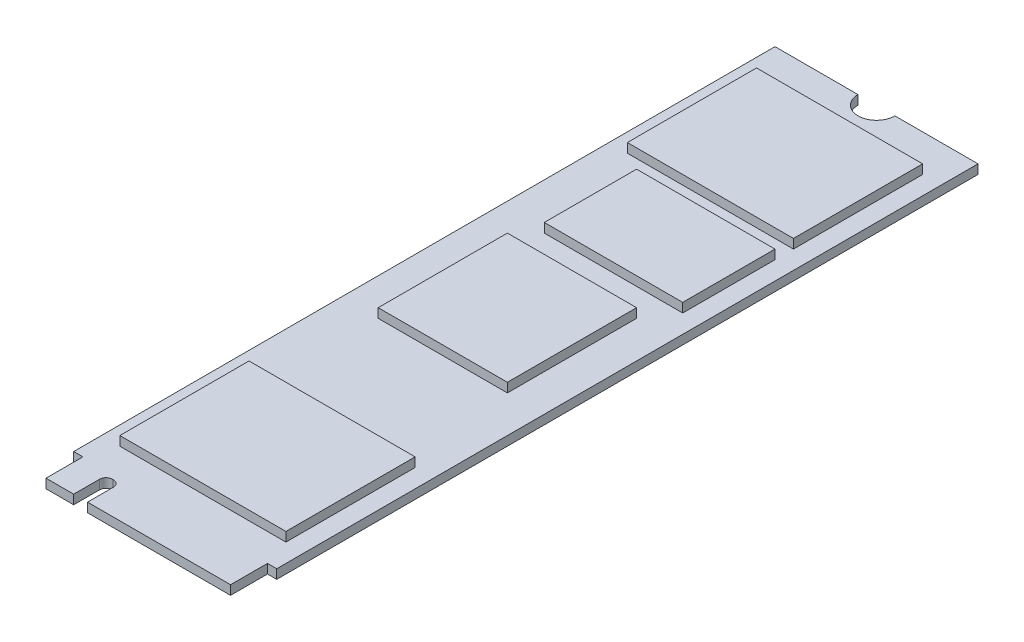
ISO-10303-21;
HEADER;
FILE_DESCRIPTION(('STEP AP214'),'2;1');
FILE_NAME('part.step','',(''),(''),'','','');
FILE_SCHEMA(('AUTOMOTIVE_DESIGN { 1 0 10303 214 1 1 1 1 }'));
ENDSEC;
DATA;
#1=APPLICATION_CONTEXT('core data for automotive mechanical design processes');
#2=APPLICATION_PROTOCOL_DEFINITION('international standard','automotive_design',2000,#1);
#3=PRODUCT_CONTEXT('',#1,'mechanical');
#4=PRODUCT('Part','Part','',(#3));
#5=PRODUCT_RELATED_PRODUCT_CATEGORY('part','',(#4));
#6=PRODUCT_DEFINITION_FORMATION('','',#4);
#7=PRODUCT_DEFINITION_CONTEXT('part definition',#1,'design');
#8=PRODUCT_DEFINITION('design','',#6,#7);
#9=PRODUCT_DEFINITION_SHAPE('','',#8);
#10=(LENGTH_UNIT() NAMED_UNIT(*) SI_UNIT(.MILLI.,.METRE.));
#11=(NAMED_UNIT(*) PLANE_ANGLE_UNIT() SI_UNIT($,.RADIAN.));
#12=(NAMED_UNIT(*) SI_UNIT($,.STERADIAN.) SOLID_ANGLE_UNIT());
#13=UNCERTAINTY_MEASURE_WITH_UNIT(LENGTH_MEASURE(1.E-05),#10,'distance_accuracy_value','');
#14=(GEOMETRIC_REPRESENTATION_CONTEXT(3) GLOBAL_UNCERTAINTY_ASSIGNED_CONTEXT((#13)) GLOBAL_UNIT_ASSIGNED_CONTEXT((#10,
#11,#12)) REPRESENTATION_CONTEXT('',''));
#15=CARTESIAN_POINT('',(0.,0.,0.));
#16=DIRECTION('',(0.,0.,1.));
#17=DIRECTION('',(1.,0.,0.));
#18=AXIS2_PLACEMENT_3D('',#15,#16,#17);
#19=CARTESIAN_POINT('',(-6.19999999999999,1.,37.2));
#20=DIRECTION('',(0.,1.,0.));
#21=DIRECTION('',(0.,0.,1.));
#22=AXIS2_PLACEMENT_3D('',#19,#20,#21);
#23=PLANE('',#22);
#24=CARTESIAN_POINT('',(0.,1.,-40.));
#25=DIRECTION('',(0.,1.,0.));
#26=DIRECTION('',(0.,0.,1.));
#27=AXIS2_PLACEMENT_3D('',#24,#25,#26);
#28=CIRCLE('',#27,2.);
#29=CARTESIAN_POINT('',(-2.00000000000001,1.,-40.));
#30=VERTEX_POINT('',#29);
#31=CARTESIAN_POINT('',(2.,1.,-40.));
#32=VERTEX_POINT('',#31);
#33=EDGE_CURVE('E362',#30,#32,#28,.T.);
#34=ORIENTED_EDGE('',*,*,#33,.F.);
#35=DIRECTION('',(-1.,0.,0.));
#36=VECTOR('',#35,1.);
#37=CARTESIAN_POINT('',(11.,1.,-40.));
#38=LINE('',#37,#36);
#39=CARTESIAN_POINT('',(-11.,1.,-40.));
#40=VERTEX_POINT('',#39);
#41=EDGE_CURVE('E385',#30,#40,#38,.T.);
#42=ORIENTED_EDGE('',*,*,#41,.T.);
#43=DIRECTION('',(0.,0.,1.));
#44=VECTOR('',#43,1.);
#45=CARTESIAN_POINT('',(-11.,1.,36.));
#46=LINE('',#45,#44);
#47=CARTESIAN_POINT('',(-11.,1.,36.));
#48=VERTEX_POINT('',#47);
#49=EDGE_CURVE('E389',#40,#48,#46,.T.);
#50=ORIENTED_EDGE('',*,*,#49,.T.);
#51=DIRECTION('',(1.,0.,0.));
#52=VECTOR('',#51,1.);
#53=CARTESIAN_POINT('',(-9.99999999999999,1.,36.));
#54=LINE('',#53,#52);
#55=CARTESIAN_POINT('',(-9.99999999999999,1.,36.));
#56=VERTEX_POINT('',#55);
#57=EDGE_CURVE('E391',#48,#56,#54,.T.);
#58=ORIENTED_EDGE('',*,*,#57,.T.);
#59=DIRECTION('',(0.,0.,1.));
#60=VECTOR('',#59,1.);
#61=CARTESIAN_POINT('',(-9.99999999999999,1.,40.));
#62=LINE('',#61,#60);
#63=CARTESIAN_POINT('',(-9.99999999999999,1.,40.));
#64=VERTEX_POINT('',#63);
#65=EDGE_CURVE('E393',#56,#64,#62,.T.);
#66=ORIENTED_EDGE('',*,*,#65,.T.);
#67=DIRECTION('',(1.,0.,0.));
#68=VECTOR('',#67,1.);
#69=CARTESIAN_POINT('',(-6.99999999999999,1.,40.));
#70=LINE('',#69,#68);
#71=CARTESIAN_POINT('',(-6.99999999999999,1.,40.));
#72=VERTEX_POINT('',#71);
#73=EDGE_CURVE('E395',#64,#72,#70,.T.);
#74=ORIENTED_EDGE('',*,*,#73,.T.);
#75=DIRECTION('',(0.,0.,-1.));
#76=VECTOR('',#75,1.);
#77=CARTESIAN_POINT('',(-7.,1.,37.2));
#78=LINE('',#77,#76);
#79=CARTESIAN_POINT('',(-7.,1.,37.2));
#80=VERTEX_POINT('',#79);
#81=EDGE_CURVE('E397',#72,#80,#78,.T.);
#82=ORIENTED_EDGE('',*,*,#81,.T.);
#83=CARTESIAN_POINT('',(-6.3,1.,37.2));
#84=DIRECTION('',(0.,-1.,0.));
#85=DIRECTION('',(0.,0.,1.));
#86=AXIS2_PLACEMENT_3D('',#83,#84,#85);
#87=CIRCLE('',#86,0.7);
#88=CARTESIAN_POINT('',(-6.29999999999999,1.,36.5));
#89=VERTEX_POINT('',#88);
#90=EDGE_CURVE('E399',#80,#89,#87,.T.);
#91=ORIENTED_EDGE('',*,*,#90,.T.);
#92=DIRECTION('',(1.,0.,0.));
#93=VECTOR('',#92,1.);
#94=CARTESIAN_POINT('',(-6.2,1.,36.5));
#95=LINE('',#94,#93);
#96=CARTESIAN_POINT('',(-6.2,1.,36.5));
#97=VERTEX_POINT('',#96);
#98=EDGE_CURVE('E401',#89,#97,#95,.T.);
#99=ORIENTED_EDGE('',*,*,#98,.T.);
#100=CARTESIAN_POINT('',(-6.19999999999999,1.,37.2));
#101=DIRECTION('',(0.,-1.,0.));
#102=DIRECTION('',(0.,0.,1.));
#103=AXIS2_PLACEMENT_3D('',#100,#101,#102);
#104=CIRCLE('',#103,0.7);
#105=CARTESIAN_POINT('',(-5.49999999999999,1.,37.2));
#106=VERTEX_POINT('',#105);
#107=EDGE_CURVE('E371',#97,#106,#104,.T.);
#108=ORIENTED_EDGE('',*,*,#107,.T.);
#109=DIRECTION('',(0.,0.,1.));
#110=VECTOR('',#109,1.);
#111=CARTESIAN_POINT('',(-5.49999999999999,1.,40.));
#112=LINE('',#111,#110);
#113=CARTESIAN_POINT('',(-5.49999999999999,1.,40.));
#114=VERTEX_POINT('',#113);
#115=EDGE_CURVE('E374',#106,#114,#112,.T.);
#116=ORIENTED_EDGE('',*,*,#115,.T.);
#117=DIRECTION('',(1.,0.,0.));
#118=VECTOR('',#117,1.);
#119=CARTESIAN_POINT('',(10.,1.,40.));
#120=LINE('',#119,#118);
#121=CARTESIAN_POINT('',(10.,1.,40.));
#122=VERTEX_POINT('',#121);
#123=EDGE_CURVE('E377',#114,#122,#120,.T.);
#124=ORIENTED_EDGE('',*,*,#123,.T.);
#125=DIRECTION('',(0.,0.,-1.));
#126=VECTOR('',#125,1.);
#127=CARTESIAN_POINT('',(10.,1.,36.));
#128=LINE('',#127,#126);
#129=CARTESIAN_POINT('',(10.,1.,36.));
#130=VERTEX_POINT('',#129);
#131=EDGE_CURVE('E379',#122,#130,#128,.T.);
#132=ORIENTED_EDGE('',*,*,#131,.T.);
#133=DIRECTION('',(1.,0.,0.));
#134=VECTOR('',#133,1.);
#135=CARTESIAN_POINT('',(11.,1.,36.));
#136=LINE('',#135,#134);
#137=CARTESIAN_POINT('',(11.,1.,36.));
#138=VERTEX_POINT('',#137);
#139=EDGE_CURVE('E381',#130,#138,#136,.T.);
#140=ORIENTED_EDGE('',*,*,#139,.T.);
#141=DIRECTION('',(0.,0.,-1.));
#142=VECTOR('',#141,1.);
#143=CARTESIAN_POINT('',(11.,1.,-40.));
#144=LINE('',#143,#142);
#145=CARTESIAN_POINT('',(11.,1.,-40.));
#146=VERTEX_POINT('',#145);
#147=EDGE_CURVE('E383',#138,#146,#144,.T.);
#148=ORIENTED_EDGE('',*,*,#147,.T.);
#149=EDGE_CURVE('E386',#146,#32,#38,.T.);
#150=ORIENTED_EDGE('',*,*,#149,.T.);
#151=EDGE_LOOP('',(#34,#42,#50,#58,#66,#74,#82,#91,#99,#108,#116,#124,#132,#140,#148,#150));
#152=FACE_BOUND('',#151,.T.);
#153=DIRECTION('',(1.,0.,0.));
#154=VECTOR('',#153,1.);
#155=CARTESIAN_POINT('',(-9.,1.,-22.));
#156=LINE('',#155,#154);
#157=CARTESIAN_POINT('',(-9.,1.,-22.));
#158=VERTEX_POINT('',#157);
#159=CARTESIAN_POINT('',(9.,1.,-22.));
#160=VERTEX_POINT('',#159);
#161=EDGE_CURVE('E347',#158,#160,#156,.T.);
#162=ORIENTED_EDGE('',*,*,#161,.F.);
#163=DIRECTION('',(0.,0.,1.));
#164=VECTOR('',#163,1.);
#165=CARTESIAN_POINT('',(-9.00000000000001,1.,-36.));
#166=LINE('',#165,#164);
#167=CARTESIAN_POINT('',(-9.00000000000001,1.,-36.));
#168=VERTEX_POINT('',#167);
#169=EDGE_CURVE('E333',#168,#158,#166,.T.);
#170=ORIENTED_EDGE('',*,*,#169,.F.);
#171=DIRECTION('',(-1.,0.,0.));
#172=VECTOR('',#171,1.);
#173=CARTESIAN_POINT('',(-9.00000000000001,1.,-36.));
#174=LINE('',#173,#172);
#175=CARTESIAN_POINT('',(8.99999999999999,1.,-36.));
#176=VERTEX_POINT('',#175);
#177=EDGE_CURVE('E338',#176,#168,#174,.T.);
#178=ORIENTED_EDGE('',*,*,#177,.F.);
#179=DIRECTION('',(0.,0.,-1.));
#180=VECTOR('',#179,1.);
#181=CARTESIAN_POINT('',(8.99999999999999,1.,-36.));
#182=LINE('',#181,#180);
#183=EDGE_CURVE('E349',#160,#176,#182,.T.);
#184=ORIENTED_EDGE('',*,*,#183,.F.);
#185=EDGE_LOOP('',(#162,#170,#178,#184));
#186=FACE_BOUND('',#185,.T.);
#187=DIRECTION('',(1.,0.,0.));
#188=VECTOR('',#187,1.);
#189=CARTESIAN_POINT('',(-6.99999999999999,1.,7.00000000000001));
#190=LINE('',#189,#188);
#191=CARTESIAN_POINT('',(-6.99999999999999,1.,7.00000000000001));
#192=VERTEX_POINT('',#191);
#193=CARTESIAN_POINT('',(7.00000000000001,1.,7.00000000000001));
#194=VERTEX_POINT('',#193);
#195=EDGE_CURVE('E318',#192,#194,#190,.T.);
#196=ORIENTED_EDGE('',*,*,#195,.F.);
#197=DIRECTION('',(0.,0.,1.));
#198=VECTOR('',#197,1.);
#199=CARTESIAN_POINT('',(-7.,1.,-6.99999999999999));
#200=LINE('',#199,#198);
#201=CARTESIAN_POINT('',(-7.,1.,-6.99999999999999));
#202=VERTEX_POINT('',#201);
#203=EDGE_CURVE('E304',#202,#192,#200,.T.);
#204=ORIENTED_EDGE('',*,*,#203,.F.);
#205=DIRECTION('',(-1.,0.,0.));
#206=VECTOR('',#205,1.);
#207=CARTESIAN_POINT('',(-7.,1.,-6.99999999999999));
#208=LINE('',#207,#206);
#209=CARTESIAN_POINT('',(7.,1.,-6.99999999999999));
#210=VERTEX_POINT('',#209);
#211=EDGE_CURVE('E309',#210,#202,#208,.T.);
#212=ORIENTED_EDGE('',*,*,#211,.F.);
#213=DIRECTION('',(0.,0.,-1.));
#214=VECTOR('',#213,1.);
#215=CARTESIAN_POINT('',(7.,1.,-6.99999999999999));
#216=LINE('',#215,#214);
#217=EDGE_CURVE('E320',#194,#210,#216,.T.);
#218=ORIENTED_EDGE('',*,*,#217,.F.);
#219=EDGE_LOOP('',(#196,#204,#212,#218));
#220=FACE_BOUND('',#219,.T.);
#221=DIRECTION('',(1.,0.,0.));
#222=VECTOR('',#221,1.);
#223=CARTESIAN_POINT('',(-6.,1.,-9.99999999999999));
#224=LINE('',#223,#222);
#225=CARTESIAN_POINT('',(-6.,1.,-9.99999999999999));
#226=VERTEX_POINT('',#225);
#227=CARTESIAN_POINT('',(9.00000000000001,1.,-9.99999999999999));
#228=VERTEX_POINT('',#227);
#229=EDGE_CURVE('E276',#226,#228,#224,.T.);
#230=ORIENTED_EDGE('',*,*,#229,.F.);
#231=DIRECTION('',(0.,0.,1.));
#232=VECTOR('',#231,1.);
#233=CARTESIAN_POINT('',(-6.,1.,-20.));
#234=LINE('',#233,#232);
#235=CARTESIAN_POINT('',(-6.,1.,-20.));
#236=VERTEX_POINT('',#235);
#237=EDGE_CURVE('E273',#236,#226,#234,.T.);
#238=ORIENTED_EDGE('',*,*,#237,.F.);
#239=DIRECTION('',(-1.,0.,0.));
#240=VECTOR('',#239,1.);
#241=CARTESIAN_POINT('',(-6.,1.,-20.));
#242=LINE('',#241,#240);
#243=CARTESIAN_POINT('',(9.,1.,-20.));
#244=VERTEX_POINT('',#243);
#245=EDGE_CURVE('E285',#244,#236,#242,.T.);
#246=ORIENTED_EDGE('',*,*,#245,.F.);
#247=DIRECTION('',(0.,0.,-1.));
#248=VECTOR('',#247,1.);
#249=CARTESIAN_POINT('',(9.,1.,-20.));
#250=LINE('',#249,#248);
#251=EDGE_CURVE('E293',#228,#244,#250,.T.);
#252=ORIENTED_EDGE('',*,*,#251,.F.);
#253=EDGE_LOOP('',(#230,#238,#246,#252));
#254=FACE_BOUND('',#253,.T.);
#255=DIRECTION('',(1.,0.,0.));
#256=VECTOR('',#255,1.);
#257=CARTESIAN_POINT('',(-9.,1.,33.));
#258=LINE('',#257,#256);
#259=CARTESIAN_POINT('',(-9.,1.,33.));
#260=VERTEX_POINT('',#259);
#261=CARTESIAN_POINT('',(9.,1.,33.));
#262=VERTEX_POINT('',#261);
#263=EDGE_CURVE('E901',#260,#262,#258,.T.);
#264=ORIENTED_EDGE('',*,*,#263,.F.);
#265=DIRECTION('',(0.,0.,1.));
#266=VECTOR('',#265,1.);
#267=CARTESIAN_POINT('',(-9.00000000000001,1.,19.));
#268=LINE('',#267,#266);
#269=CARTESIAN_POINT('',(-9.00000000000001,1.,19.));
#270=VERTEX_POINT('',#269);
#271=EDGE_CURVE('E271',#270,#260,#268,.T.);
#272=ORIENTED_EDGE('',*,*,#271,.F.);
#273=DIRECTION('',(-1.,0.,0.));
#274=VECTOR('',#273,1.);
#275=CARTESIAN_POINT('',(-9.00000000000001,1.,19.));
#276=LINE('',#275,#274);
#277=CARTESIAN_POINT('',(8.99999999999999,1.,19.));
#278=VERTEX_POINT('',#277);
#279=EDGE_CURVE('E267',#278,#270,#276,.T.);
#280=ORIENTED_EDGE('',*,*,#279,.F.);
#281=DIRECTION('',(0.,0.,-1.));
#282=VECTOR('',#281,1.);
#283=CARTESIAN_POINT('',(8.99999999999999,1.,19.));
#284=LINE('',#283,#282);
#285=EDGE_CURVE('E898',#262,#278,#284,.T.);
#286=ORIENTED_EDGE('',*,*,#285,.F.);
#287=EDGE_LOOP('',(#264,#272,#280,#286));
#288=FACE_BOUND('',#287,.T.);
#289=ADVANCED_FACE('F38',(#152,#186,#220,#254,#288),#23,.T.);
#290=CARTESIAN_POINT('',(11.,1.,-40.));
#291=DIRECTION('',(0.,0.,1.));
#292=DIRECTION('',(1.,0.,0.));
#293=AXIS2_PLACEMENT_3D('',#290,#291,#292);
#294=PLANE('',#293);
#295=DIRECTION('',(-1.,0.,0.));
#296=VECTOR('',#295,1.);
#297=CARTESIAN_POINT('',(11.,0.,-40.));
#298=LINE('',#297,#296);
#299=CARTESIAN_POINT('',(11.,0.,-40.));
#300=VERTEX_POINT('',#299);
#301=CARTESIAN_POINT('',(2.,0.,-40.));
#302=VERTEX_POINT('',#301);
#303=EDGE_CURVE('E417',#300,#302,#298,.T.);
#304=ORIENTED_EDGE('',*,*,#303,.T.);
#305=DIRECTION('',(0.,1.,0.));
#306=VECTOR('',#305,1.);
#307=CARTESIAN_POINT('',(2.,0.,-40.));
#308=LINE('',#307,#306);
#309=EDGE_CURVE('E367',#302,#32,#308,.T.);
#310=ORIENTED_EDGE('',*,*,#309,.T.);
#311=ORIENTED_EDGE('',*,*,#149,.F.);
#312=DIRECTION('',(0.,-1.,0.));
#313=VECTOR('',#312,1.);
#314=CARTESIAN_POINT('',(11.,1.,-40.));
#315=LINE('',#314,#313);
#316=EDGE_CURVE('E456',#146,#300,#315,.T.);
#317=ORIENTED_EDGE('',*,*,#316,.T.);
#318=EDGE_LOOP('',(#304,#310,#311,#317));
#319=FACE_BOUND('',#318,.T.);
#320=ADVANCED_FACE('F540',(#319),#294,.F.);
#321=CARTESIAN_POINT('',(-6.19999999999999,1.,37.2));
#322=DIRECTION('',(0.,-1.,0.));
#323=DIRECTION('',(0.,0.,-1.));
#324=AXIS2_PLACEMENT_3D('',#321,#322,#323);
#325=CYLINDRICAL_SURFACE('',#324,0.7);
#326=CARTESIAN_POINT('',(-6.19999999999999,0.,37.2));
#327=DIRECTION('',(0.,-1.,0.));
#328=DIRECTION('',(0.,0.,1.));
#329=AXIS2_PLACEMENT_3D('',#326,#327,#328);
#330=CIRCLE('',#329,0.7);
#331=CARTESIAN_POINT('',(-6.2,0.,36.5));
#332=VERTEX_POINT('',#331);
#333=CARTESIAN_POINT('',(-5.49999999999999,0.,37.2));
#334=VERTEX_POINT('',#333);
#335=EDGE_CURVE('E370',#332,#334,#330,.T.);
#336=ORIENTED_EDGE('',*,*,#335,.T.);
#337=DIRECTION('',(0.,-1.,0.));
#338=VECTOR('',#337,1.);
#339=CARTESIAN_POINT('',(-5.49999999999999,1.,37.2));
#340=LINE('',#339,#338);
#341=EDGE_CURVE('E46',#106,#334,#340,.T.);
#342=ORIENTED_EDGE('',*,*,#341,.F.);
#343=ORIENTED_EDGE('',*,*,#107,.F.);
#344=DIRECTION('',(0.,-1.,0.));
#345=VECTOR('',#344,1.);
#346=CARTESIAN_POINT('',(-6.2,1.,36.5));
#347=LINE('',#346,#345);
#348=EDGE_CURVE('E403',#97,#332,#347,.T.);
#349=ORIENTED_EDGE('',*,*,#348,.T.);
#350=EDGE_LOOP('',(#336,#342,#343,#349));
#351=FACE_BOUND('',#350,.T.);
#352=ADVANCED_FACE('F40',(#351),#325,.F.);
#353=CARTESIAN_POINT('',(-5.49999999999999,1.,40.));
#354=DIRECTION('',(1.,0.,0.));
#355=DIRECTION('',(0.,0.,-1.));
#356=AXIS2_PLACEMENT_3D('',#353,#354,#355);
#357=PLANE('',#356);
#358=DIRECTION('',(0.,0.,1.));
#359=VECTOR('',#358,1.);
#360=CARTESIAN_POINT('',(-5.49999999999999,0.,40.));
#361=LINE('',#360,#359);
#362=CARTESIAN_POINT('',(-5.49999999999999,0.,40.));
#363=VERTEX_POINT('',#362);
#364=EDGE_CURVE('E406',#334,#363,#361,.T.);
#365=ORIENTED_EDGE('',*,*,#364,.T.);
#366=DIRECTION('',(0.,-1.,0.));
#367=VECTOR('',#366,1.);
#368=CARTESIAN_POINT('',(-5.49999999999999,1.,40.));
#369=LINE('',#368,#367);
#370=EDGE_CURVE('E468',#114,#363,#369,.T.);
#371=ORIENTED_EDGE('',*,*,#370,.F.);
#372=ORIENTED_EDGE('',*,*,#115,.F.);
#373=ORIENTED_EDGE('',*,*,#341,.T.);
#374=EDGE_LOOP('',(#365,#371,#372,#373));
#375=FACE_BOUND('',#374,.T.);
#376=ADVANCED_FACE('F473',(#375),#357,.F.);
#377=CARTESIAN_POINT('',(10.,1.,40.));
#378=DIRECTION('',(0.,0.,-1.));
#379=DIRECTION('',(-1.,0.,0.));
#380=AXIS2_PLACEMENT_3D('',#377,#378,#379);
#381=PLANE('',#380);
#382=DIRECTION('',(1.,0.,0.));
#383=VECTOR('',#382,1.);
#384=CARTESIAN_POINT('',(10.,0.,40.));
#385=LINE('',#384,#383);
#386=CARTESIAN_POINT('',(10.,0.,40.));
#387=VERTEX_POINT('',#386);
#388=EDGE_CURVE('E408',#363,#387,#385,.T.);
#389=ORIENTED_EDGE('',*,*,#388,.T.);
#390=DIRECTION('',(0.,-1.,0.));
#391=VECTOR('',#390,1.);
#392=CARTESIAN_POINT('',(10.,1.,40.));
#393=LINE('',#392,#391);
#394=EDGE_CURVE('E465',#122,#387,#393,.T.);
#395=ORIENTED_EDGE('',*,*,#394,.F.);
#396=ORIENTED_EDGE('',*,*,#123,.F.);
#397=ORIENTED_EDGE('',*,*,#370,.T.);
#398=EDGE_LOOP('',(#389,#395,#396,#397));
#399=FACE_BOUND('',#398,.T.);
#400=ADVANCED_FACE('F489',(#399),#381,.F.);
#401=CARTESIAN_POINT('',(10.,1.,36.));
#402=DIRECTION('',(-1.,0.,0.));
#403=DIRECTION('',(0.,0.,1.));
#404=AXIS2_PLACEMENT_3D('',#401,#402,#403);
#405=PLANE('',#404);
#406=DIRECTION('',(0.,0.,-1.));
#407=VECTOR('',#406,1.);
#408=CARTESIAN_POINT('',(10.,0.,36.));
#409=LINE('',#408,#407);
#410=CARTESIAN_POINT('',(10.,0.,36.));
#411=VERTEX_POINT('',#410);
#412=EDGE_CURVE('E410',#387,#411,#409,.T.);
#413=ORIENTED_EDGE('',*,*,#412,.T.);
#414=DIRECTION('',(0.,-1.,0.));
#415=VECTOR('',#414,1.);
#416=CARTESIAN_POINT('',(10.,1.,36.));
#417=LINE('',#416,#415);
#418=EDGE_CURVE('E462',#130,#411,#417,.T.);
#419=ORIENTED_EDGE('',*,*,#418,.F.);
#420=ORIENTED_EDGE('',*,*,#131,.F.);
#421=ORIENTED_EDGE('',*,*,#394,.T.);
#422=EDGE_LOOP('',(#413,#419,#420,#421));
#423=FACE_BOUND('',#422,.T.);
#424=ADVANCED_FACE('F493',(#423),#405,.F.);
#425=CARTESIAN_POINT('',(11.,1.,36.));
#426=DIRECTION('',(0.,0.,-1.));
#427=DIRECTION('',(-1.,0.,0.));
#428=AXIS2_PLACEMENT_3D('',#425,#426,#427);
#429=PLANE('',#428);
#430=DIRECTION('',(1.,0.,0.));
#431=VECTOR('',#430,1.);
#432=CARTESIAN_POINT('',(11.,0.,36.));
#433=LINE('',#432,#431);
#434=CARTESIAN_POINT('',(11.,0.,36.));
#435=VERTEX_POINT('',#434);
#436=EDGE_CURVE('E412',#411,#435,#433,.T.);
#437=ORIENTED_EDGE('',*,*,#436,.T.);
#438=DIRECTION('',(0.,-1.,0.));
#439=VECTOR('',#438,1.);
#440=CARTESIAN_POINT('',(11.,1.,36.));
#441=LINE('',#440,#439);
#442=EDGE_CURVE('E459',#138,#435,#441,.T.);
#443=ORIENTED_EDGE('',*,*,#442,.F.);
#444=ORIENTED_EDGE('',*,*,#139,.F.);
#445=ORIENTED_EDGE('',*,*,#418,.T.);
#446=EDGE_LOOP('',(#437,#443,#444,#445));
#447=FACE_BOUND('',#446,.T.);
#448=ADVANCED_FACE('F547',(#447),#429,.F.);
#449=CARTESIAN_POINT('',(11.,1.,-40.));
#450=DIRECTION('',(-1.,0.,0.));
#451=DIRECTION('',(0.,0.,1.));
#452=AXIS2_PLACEMENT_3D('',#449,#450,#451);
#453=PLANE('',#452);
#454=DIRECTION('',(0.,0.,-1.));
#455=VECTOR('',#454,1.);
#456=CARTESIAN_POINT('',(11.,0.,-40.));
#457=LINE('',#456,#455);
#458=EDGE_CURVE('E414',#435,#300,#457,.T.);
#459=ORIENTED_EDGE('',*,*,#458,.T.);
#460=ORIENTED_EDGE('',*,*,#316,.F.);
#461=ORIENTED_EDGE('',*,*,#147,.F.);
#462=ORIENTED_EDGE('',*,*,#442,.T.);
#463=EDGE_LOOP('',(#459,#460,#461,#462));
#464=FACE_BOUND('',#463,.T.);
#465=ADVANCED_FACE('F545',(#464),#453,.F.);
#466=ORIENTED_EDGE('',*,*,#41,.F.);
#467=DIRECTION('',(0.,1.,0.));
#468=VECTOR('',#467,1.);
#469=CARTESIAN_POINT('',(-2.00000000000001,0.,-40.));
#470=LINE('',#469,#468);
#471=CARTESIAN_POINT('',(-2.00000000000001,0.,-40.));
#472=VERTEX_POINT('',#471);
#473=EDGE_CURVE('E364',#30,#472,#470,.F.);
#474=ORIENTED_EDGE('',*,*,#473,.T.);
#475=CARTESIAN_POINT('',(-11.,0.,-40.));
#476=VERTEX_POINT('',#475);
#477=EDGE_CURVE('E416',#472,#476,#298,.T.);
#478=ORIENTED_EDGE('',*,*,#477,.T.);
#479=DIRECTION('',(0.,-1.,0.));
#480=VECTOR('',#479,1.);
#481=CARTESIAN_POINT('',(-11.,1.,-40.));
#482=LINE('',#481,#480);
#483=EDGE_CURVE('E453',#40,#476,#482,.T.);
#484=ORIENTED_EDGE('',*,*,#483,.F.);
#485=EDGE_LOOP('',(#466,#474,#478,#484));
#486=FACE_BOUND('',#485,.T.);
#487=ADVANCED_FACE('F535',(#486),#294,.F.);
#488=CARTESIAN_POINT('',(-11.,1.,36.));
#489=DIRECTION('',(1.,0.,0.));
#490=DIRECTION('',(0.,0.,-1.));
#491=AXIS2_PLACEMENT_3D('',#488,#489,#490);
#492=PLANE('',#491);
#493=DIRECTION('',(0.,0.,1.));
#494=VECTOR('',#493,1.);
#495=CARTESIAN_POINT('',(-11.,0.,36.));
#496=LINE('',#495,#494);
#497=CARTESIAN_POINT('',(-11.,0.,36.));
#498=VERTEX_POINT('',#497);
#499=EDGE_CURVE('E420',#476,#498,#496,.T.);
#500=ORIENTED_EDGE('',*,*,#499,.T.);
#501=DIRECTION('',(0.,-1.,0.));
#502=VECTOR('',#501,1.);
#503=CARTESIAN_POINT('',(-11.,1.,36.));
#504=LINE('',#503,#502);
#505=EDGE_CURVE('E450',#48,#498,#504,.T.);
#506=ORIENTED_EDGE('',*,*,#505,.F.);
#507=ORIENTED_EDGE('',*,*,#49,.F.);
#508=ORIENTED_EDGE('',*,*,#483,.T.);
#509=EDGE_LOOP('',(#500,#506,#507,#508));
#510=FACE_BOUND('',#509,.T.);
#511=ADVANCED_FACE('F531',(#510),#492,.F.);
#512=CARTESIAN_POINT('',(-9.99999999999999,1.,36.));
#513=DIRECTION('',(0.,0.,-1.));
#514=DIRECTION('',(-1.,0.,0.));
#515=AXIS2_PLACEMENT_3D('',#512,#513,#514);
#516=PLANE('',#515);
#517=DIRECTION('',(1.,0.,0.));
#518=VECTOR('',#517,1.);
#519=CARTESIAN_POINT('',(-9.99999999999999,0.,36.));
#520=LINE('',#519,#518);
#521=CARTESIAN_POINT('',(-9.99999999999999,0.,36.));
#522=VERTEX_POINT('',#521);
#523=EDGE_CURVE('E422',#498,#522,#520,.T.);
#524=ORIENTED_EDGE('',*,*,#523,.T.);
#525=DIRECTION('',(0.,-1.,0.));
#526=VECTOR('',#525,1.);
#527=CARTESIAN_POINT('',(-9.99999999999999,1.,36.));
#528=LINE('',#527,#526);
#529=EDGE_CURVE('E447',#56,#522,#528,.T.);
#530=ORIENTED_EDGE('',*,*,#529,.F.);
#531=ORIENTED_EDGE('',*,*,#57,.F.);
#532=ORIENTED_EDGE('',*,*,#505,.T.);
#533=EDGE_LOOP('',(#524,#530,#531,#532));
#534=FACE_BOUND('',#533,.T.);
#535=ADVANCED_FACE('F526',(#534),#516,.F.);
#536=CARTESIAN_POINT('',(-9.99999999999999,1.,40.));
#537=DIRECTION('',(1.,0.,0.));
#538=DIRECTION('',(0.,0.,-1.));
#539=AXIS2_PLACEMENT_3D('',#536,#537,#538);
#540=PLANE('',#539);
#541=DIRECTION('',(0.,0.,1.));
#542=VECTOR('',#541,1.);
#543=CARTESIAN_POINT('',(-9.99999999999999,0.,40.));
#544=LINE('',#543,#542);
#545=CARTESIAN_POINT('',(-9.99999999999999,0.,40.));
#546=VERTEX_POINT('',#545);
#547=EDGE_CURVE('E424',#522,#546,#544,.T.);
#548=ORIENTED_EDGE('',*,*,#547,.T.);
#549=DIRECTION('',(0.,-1.,0.));
#550=VECTOR('',#549,1.);
#551=CARTESIAN_POINT('',(-9.99999999999999,1.,40.));
#552=LINE('',#551,#550);
#553=EDGE_CURVE('E444',#64,#546,#552,.T.);
#554=ORIENTED_EDGE('',*,*,#553,.F.);
#555=ORIENTED_EDGE('',*,*,#65,.F.);
#556=ORIENTED_EDGE('',*,*,#529,.T.);
#557=EDGE_LOOP('',(#548,#554,#555,#556));
#558=FACE_BOUND('',#557,.T.);
#559=ADVANCED_FACE('F521',(#558),#540,.F.);
#560=CARTESIAN_POINT('',(-6.99999999999999,1.,40.));
#561=DIRECTION('',(0.,0.,-1.));
#562=DIRECTION('',(-1.,0.,0.));
#563=AXIS2_PLACEMENT_3D('',#560,#561,#562);
#564=PLANE('',#563);
#565=DIRECTION('',(1.,0.,0.));
#566=VECTOR('',#565,1.);
#567=CARTESIAN_POINT('',(-6.99999999999999,0.,40.));
#568=LINE('',#567,#566);
#569=CARTESIAN_POINT('',(-6.99999999999999,0.,40.));
#570=VERTEX_POINT('',#569);
#571=EDGE_CURVE('E426',#546,#570,#568,.T.);
#572=ORIENTED_EDGE('',*,*,#571,.T.);
#573=DIRECTION('',(0.,-1.,0.));
#574=VECTOR('',#573,1.);
#575=CARTESIAN_POINT('',(-6.99999999999999,1.,40.));
#576=LINE('',#575,#574);
#577=EDGE_CURVE('E441',#72,#570,#576,.T.);
#578=ORIENTED_EDGE('',*,*,#577,.F.);
#579=ORIENTED_EDGE('',*,*,#73,.F.);
#580=ORIENTED_EDGE('',*,*,#553,.T.);
#581=EDGE_LOOP('',(#572,#578,#579,#580));
#582=FACE_BOUND('',#581,.T.);
#583=ADVANCED_FACE('F517',(#582),#564,.F.);
#584=CARTESIAN_POINT('',(-7.,1.,37.2));
#585=DIRECTION('',(-1.,0.,0.));
#586=DIRECTION('',(0.,0.,1.));
#587=AXIS2_PLACEMENT_3D('',#584,#585,#586);
#588=PLANE('',#587);
#589=DIRECTION('',(0.,0.,-1.));
#590=VECTOR('',#589,1.);
#591=CARTESIAN_POINT('',(-7.,0.,37.2));
#592=LINE('',#591,#590);
#593=CARTESIAN_POINT('',(-7.,0.,37.2));
#594=VERTEX_POINT('',#593);
#595=EDGE_CURVE('E428',#570,#594,#592,.T.);
#596=ORIENTED_EDGE('',*,*,#595,.T.);
#597=DIRECTION('',(0.,-1.,0.));
#598=VECTOR('',#597,1.);
#599=CARTESIAN_POINT('',(-7.,1.,37.2));
#600=LINE('',#599,#598);
#601=EDGE_CURVE('E438',#80,#594,#600,.T.);
#602=ORIENTED_EDGE('',*,*,#601,.F.);
#603=ORIENTED_EDGE('',*,*,#81,.F.);
#604=ORIENTED_EDGE('',*,*,#577,.T.);
#605=EDGE_LOOP('',(#596,#602,#603,#604));
#606=FACE_BOUND('',#605,.T.);
#607=ADVANCED_FACE('F512',(#606),#588,.F.);
#608=CARTESIAN_POINT('',(-6.3,1.,37.2));
#609=DIRECTION('',(0.,-1.,0.));
#610=DIRECTION('',(0.,0.,-1.));
#611=AXIS2_PLACEMENT_3D('',#608,#609,#610);
#612=CYLINDRICAL_SURFACE('',#611,0.7);
#613=CARTESIAN_POINT('',(-6.3,0.,37.2));
#614=DIRECTION('',(0.,-1.,0.));
#615=DIRECTION('',(0.,0.,1.));
#616=AXIS2_PLACEMENT_3D('',#613,#614,#615);
#617=CIRCLE('',#616,0.7);
#618=CARTESIAN_POINT('',(-6.29999999999999,0.,36.5));
#619=VERTEX_POINT('',#618);
#620=EDGE_CURVE('E430',#594,#619,#617,.T.);
#621=ORIENTED_EDGE('',*,*,#620,.T.);
#622=DIRECTION('',(0.,-1.,0.));
#623=VECTOR('',#622,1.);
#624=CARTESIAN_POINT('',(-6.29999999999999,1.,36.5));
#625=LINE('',#624,#623);
#626=EDGE_CURVE('E435',#89,#619,#625,.T.);
#627=ORIENTED_EDGE('',*,*,#626,.F.);
#628=ORIENTED_EDGE('',*,*,#90,.F.);
#629=ORIENTED_EDGE('',*,*,#601,.T.);
#630=EDGE_LOOP('',(#621,#627,#628,#629));
#631=FACE_BOUND('',#630,.T.);
#632=ADVANCED_FACE('F506',(#631),#612,.F.);
#633=CARTESIAN_POINT('',(-6.2,1.,36.5));
#634=DIRECTION('',(0.,0.,-1.));
#635=DIRECTION('',(-1.,0.,0.));
#636=AXIS2_PLACEMENT_3D('',#633,#634,#635);
#637=PLANE('',#636);
#638=DIRECTION('',(1.,0.,0.));
#639=VECTOR('',#638,1.);
#640=CARTESIAN_POINT('',(-6.2,0.,36.5));
#641=LINE('',#640,#639);
#642=EDGE_CURVE('E375',#619,#332,#641,.T.);
#643=ORIENTED_EDGE('',*,*,#642,.T.);
#644=ORIENTED_EDGE('',*,*,#348,.F.);
#645=ORIENTED_EDGE('',*,*,#98,.F.);
#646=ORIENTED_EDGE('',*,*,#626,.T.);
#647=EDGE_LOOP('',(#643,#644,#645,#646));
#648=FACE_BOUND('',#647,.T.);
#649=ADVANCED_FACE('F504',(#648),#637,.F.);
#650=CARTESIAN_POINT('',(-6.19999999999999,0.,37.2));
#651=DIRECTION('',(0.,1.,0.));
#652=DIRECTION('',(0.,0.,1.));
#653=AXIS2_PLACEMENT_3D('',#650,#651,#652);
#654=PLANE('',#653);
#655=ORIENTED_EDGE('',*,*,#477,.F.);
#656=CARTESIAN_POINT('',(0.,0.,-40.));
#657=DIRECTION('',(0.,1.,0.));
#658=DIRECTION('',(0.,0.,1.));
#659=AXIS2_PLACEMENT_3D('',#656,#657,#658);
#660=CIRCLE('',#659,2.);
#661=EDGE_CURVE('E11',#472,#302,#660,.T.);
#662=ORIENTED_EDGE('',*,*,#661,.T.);
#663=ORIENTED_EDGE('',*,*,#303,.F.);
#664=ORIENTED_EDGE('',*,*,#458,.F.);
#665=ORIENTED_EDGE('',*,*,#436,.F.);
#666=ORIENTED_EDGE('',*,*,#412,.F.);
#667=ORIENTED_EDGE('',*,*,#388,.F.);
#668=ORIENTED_EDGE('',*,*,#364,.F.);
#669=ORIENTED_EDGE('',*,*,#335,.F.);
#670=ORIENTED_EDGE('',*,*,#642,.F.);
#671=ORIENTED_EDGE('',*,*,#620,.F.);
#672=ORIENTED_EDGE('',*,*,#595,.F.);
#673=ORIENTED_EDGE('',*,*,#571,.F.);
#674=ORIENTED_EDGE('',*,*,#547,.F.);
#675=ORIENTED_EDGE('',*,*,#523,.F.);
#676=ORIENTED_EDGE('',*,*,#499,.F.);
#677=EDGE_LOOP('',(#655,#662,#663,#664,#665,#666,#667,#668,#669,#670,#671,#672,#673,#674,#675,#676));
#678=FACE_BOUND('',#677,.T.);
#679=ADVANCED_FACE('F482',(#678),#654,.F.);
#680=CARTESIAN_POINT('',(0.,0.,-40.));
#681=DIRECTION('',(0.,1.,0.));
#682=DIRECTION('',(0.,0.,1.));
#683=AXIS2_PLACEMENT_3D('',#680,#681,#682);
#684=CYLINDRICAL_SURFACE('',#683,2.);
#685=ORIENTED_EDGE('',*,*,#661,.F.);
#686=ORIENTED_EDGE('',*,*,#473,.F.);
#687=ORIENTED_EDGE('',*,*,#33,.T.);
#688=ORIENTED_EDGE('',*,*,#309,.F.);
#689=EDGE_LOOP('',(#685,#686,#687,#688));
#690=FACE_BOUND('',#689,.T.);
#691=ADVANCED_FACE('F564',(#690),#684,.F.);
#692=CARTESIAN_POINT('',(-9.00000000000001,2.,-36.));
#693=DIRECTION('',(1.,0.,0.));
#694=DIRECTION('',(0.,0.,-1.));
#695=AXIS2_PLACEMENT_3D('',#692,#693,#694);
#696=PLANE('',#695);
#697=ORIENTED_EDGE('',*,*,#169,.T.);
#698=DIRECTION('',(0.,-1.,0.));
#699=VECTOR('',#698,1.);
#700=CARTESIAN_POINT('',(-9.,2.,-22.));
#701=LINE('',#700,#699);
#702=CARTESIAN_POINT('',(-9.,2.,-22.));
#703=VERTEX_POINT('',#702);
#704=EDGE_CURVE('E360',#703,#158,#701,.T.);
#705=ORIENTED_EDGE('',*,*,#704,.F.);
#706=DIRECTION('',(0.,0.,1.));
#707=VECTOR('',#706,1.);
#708=CARTESIAN_POINT('',(-9.00000000000001,2.,-36.));
#709=LINE('',#708,#707);
#710=CARTESIAN_POINT('',(-9.00000000000001,2.,-36.));
#711=VERTEX_POINT('',#710);
#712=EDGE_CURVE('E334',#711,#703,#709,.T.);
#713=ORIENTED_EDGE('',*,*,#712,.F.);
#714=DIRECTION('',(0.,-1.,0.));
#715=VECTOR('',#714,1.);
#716=CARTESIAN_POINT('',(-9.00000000000001,2.,-36.));
#717=LINE('',#716,#715);
#718=EDGE_CURVE('E344',#711,#168,#717,.T.);
#719=ORIENTED_EDGE('',*,*,#718,.T.);
#720=EDGE_LOOP('',(#697,#705,#713,#719));
#721=FACE_BOUND('',#720,.T.);
#722=ADVANCED_FACE('F625',(#721),#696,.F.);
#723=CARTESIAN_POINT('',(-9.,2.,-22.));
#724=DIRECTION('',(0.,0.,-1.));
#725=DIRECTION('',(-1.,0.,0.));
#726=AXIS2_PLACEMENT_3D('',#723,#724,#725);
#727=PLANE('',#726);
#728=ORIENTED_EDGE('',*,*,#161,.T.);
#729=DIRECTION('',(0.,-1.,0.));
#730=VECTOR('',#729,1.);
#731=CARTESIAN_POINT('',(9.,2.,-22.));
#732=LINE('',#731,#730);
#733=CARTESIAN_POINT('',(9.,2.,-22.));
#734=VERTEX_POINT('',#733);
#735=EDGE_CURVE('E357',#734,#160,#732,.T.);
#736=ORIENTED_EDGE('',*,*,#735,.F.);
#737=DIRECTION('',(1.,0.,0.));
#738=VECTOR('',#737,1.);
#739=CARTESIAN_POINT('',(-9.,2.,-22.));
#740=LINE('',#739,#738);
#741=EDGE_CURVE('E337',#703,#734,#740,.T.);
#742=ORIENTED_EDGE('',*,*,#741,.F.);
#743=ORIENTED_EDGE('',*,*,#704,.T.);
#744=EDGE_LOOP('',(#728,#736,#742,#743));
#745=FACE_BOUND('',#744,.T.);
#746=ADVANCED_FACE('F632',(#745),#727,.F.);
#747=CARTESIAN_POINT('',(8.99999999999999,2.,-36.));
#748=DIRECTION('',(-1.,0.,0.));
#749=DIRECTION('',(0.,0.,1.));
#750=AXIS2_PLACEMENT_3D('',#747,#748,#749);
#751=PLANE('',#750);
#752=ORIENTED_EDGE('',*,*,#183,.T.);
#753=DIRECTION('',(0.,-1.,0.));
#754=VECTOR('',#753,1.);
#755=CARTESIAN_POINT('',(8.99999999999999,2.,-36.));
#756=LINE('',#755,#754);
#757=CARTESIAN_POINT('',(8.99999999999999,2.,-36.));
#758=VERTEX_POINT('',#757);
#759=EDGE_CURVE('E355',#758,#176,#756,.T.);
#760=ORIENTED_EDGE('',*,*,#759,.F.);
#761=DIRECTION('',(0.,0.,-1.));
#762=VECTOR('',#761,1.);
#763=CARTESIAN_POINT('',(8.99999999999999,2.,-36.));
#764=LINE('',#763,#762);
#765=EDGE_CURVE('E340',#734,#758,#764,.T.);
#766=ORIENTED_EDGE('',*,*,#765,.F.);
#767=ORIENTED_EDGE('',*,*,#735,.T.);
#768=EDGE_LOOP('',(#752,#760,#766,#767));
#769=FACE_BOUND('',#768,.T.);
#770=ADVANCED_FACE('F639',(#769),#751,.F.);
#771=CARTESIAN_POINT('',(-9.00000000000001,2.,-36.));
#772=DIRECTION('',(0.,0.,1.));
#773=DIRECTION('',(1.,0.,0.));
#774=AXIS2_PLACEMENT_3D('',#771,#772,#773);
#775=PLANE('',#774);
#776=ORIENTED_EDGE('',*,*,#177,.T.);
#777=ORIENTED_EDGE('',*,*,#718,.F.);
#778=DIRECTION('',(-1.,0.,0.));
#779=VECTOR('',#778,1.);
#780=CARTESIAN_POINT('',(-9.00000000000001,2.,-36.));
#781=LINE('',#780,#779);
#782=EDGE_CURVE('E342',#758,#711,#781,.T.);
#783=ORIENTED_EDGE('',*,*,#782,.F.);
#784=ORIENTED_EDGE('',*,*,#759,.T.);
#785=EDGE_LOOP('',(#776,#777,#783,#784));
#786=FACE_BOUND('',#785,.T.);
#787=ADVANCED_FACE('F647',(#786),#775,.F.);
#788=CARTESIAN_POINT('',(0.,2.,0.));
#789=DIRECTION('',(0.,1.,0.));
#790=DIRECTION('',(0.,0.,1.));
#791=AXIS2_PLACEMENT_3D('',#788,#789,#790);
#792=PLANE('',#791);
#793=ORIENTED_EDGE('',*,*,#712,.T.);
#794=ORIENTED_EDGE('',*,*,#741,.T.);
#795=ORIENTED_EDGE('',*,*,#765,.T.);
#796=ORIENTED_EDGE('',*,*,#782,.T.);
#797=EDGE_LOOP('',(#793,#794,#795,#796));
#798=FACE_BOUND('',#797,.T.);
#799=ADVANCED_FACE('F655',(#798),#792,.T.);
#800=CARTESIAN_POINT('',(-7.,2.,-6.99999999999999));
#801=DIRECTION('',(1.,0.,0.));
#802=DIRECTION('',(0.,0.,-1.));
#803=AXIS2_PLACEMENT_3D('',#800,#801,#802);
#804=PLANE('',#803);
#805=ORIENTED_EDGE('',*,*,#203,.T.);
#806=DIRECTION('',(0.,-1.,0.));
#807=VECTOR('',#806,1.);
#808=CARTESIAN_POINT('',(-6.99999999999999,2.,7.00000000000001));
#809=LINE('',#808,#807);
#810=CARTESIAN_POINT('',(-6.99999999999999,2.,7.00000000000001));
#811=VERTEX_POINT('',#810);
#812=EDGE_CURVE('E331',#811,#192,#809,.T.);
#813=ORIENTED_EDGE('',*,*,#812,.F.);
#814=DIRECTION('',(0.,0.,1.));
#815=VECTOR('',#814,1.);
#816=CARTESIAN_POINT('',(-7.,2.,-6.99999999999999));
#817=LINE('',#816,#815);
#818=CARTESIAN_POINT('',(-7.,2.,-6.99999999999999));
#819=VERTEX_POINT('',#818);
#820=EDGE_CURVE('E305',#819,#811,#817,.T.);
#821=ORIENTED_EDGE('',*,*,#820,.F.);
#822=DIRECTION('',(0.,-1.,0.));
#823=VECTOR('',#822,1.);
#824=CARTESIAN_POINT('',(-7.,2.,-6.99999999999999));
#825=LINE('',#824,#823);
#826=EDGE_CURVE('E315',#819,#202,#825,.T.);
#827=ORIENTED_EDGE('',*,*,#826,.T.);
#828=EDGE_LOOP('',(#805,#813,#821,#827));
#829=FACE_BOUND('',#828,.T.);
#830=ADVANCED_FACE('F664',(#829),#804,.F.);
#831=CARTESIAN_POINT('',(-6.99999999999999,2.,7.00000000000001));
#832=DIRECTION('',(0.,0.,-1.));
#833=DIRECTION('',(-1.,0.,0.));
#834=AXIS2_PLACEMENT_3D('',#831,#832,#833);
#835=PLANE('',#834);
#836=ORIENTED_EDGE('',*,*,#195,.T.);
#837=DIRECTION('',(0.,-1.,0.));
#838=VECTOR('',#837,1.);
#839=CARTESIAN_POINT('',(7.00000000000001,2.,7.00000000000001));
#840=LINE('',#839,#838);
#841=CARTESIAN_POINT('',(7.00000000000001,2.,7.00000000000001));
#842=VERTEX_POINT('',#841);
#843=EDGE_CURVE('E328',#842,#194,#840,.T.);
#844=ORIENTED_EDGE('',*,*,#843,.F.);
#845=DIRECTION('',(1.,0.,0.));
#846=VECTOR('',#845,1.);
#847=CARTESIAN_POINT('',(-6.99999999999999,2.,7.00000000000001));
#848=LINE('',#847,#846);
#849=EDGE_CURVE('E308',#811,#842,#848,.T.);
#850=ORIENTED_EDGE('',*,*,#849,.F.);
#851=ORIENTED_EDGE('',*,*,#812,.T.);
#852=EDGE_LOOP('',(#836,#844,#850,#851));
#853=FACE_BOUND('',#852,.T.);
#854=ADVANCED_FACE('F672',(#853),#835,.F.);
#855=CARTESIAN_POINT('',(7.,2.,-6.99999999999999));
#856=DIRECTION('',(-1.,0.,0.));
#857=DIRECTION('',(0.,0.,1.));
#858=AXIS2_PLACEMENT_3D('',#855,#856,#857);
#859=PLANE('',#858);
#860=ORIENTED_EDGE('',*,*,#217,.T.);
#861=DIRECTION('',(0.,-1.,0.));
#862=VECTOR('',#861,1.);
#863=CARTESIAN_POINT('',(7.,2.,-6.99999999999999));
#864=LINE('',#863,#862);
#865=CARTESIAN_POINT('',(7.,2.,-6.99999999999999));
#866=VERTEX_POINT('',#865);
#867=EDGE_CURVE('E326',#866,#210,#864,.T.);
#868=ORIENTED_EDGE('',*,*,#867,.F.);
#869=DIRECTION('',(0.,0.,-1.));
#870=VECTOR('',#869,1.);
#871=CARTESIAN_POINT('',(7.,2.,-6.99999999999999));
#872=LINE('',#871,#870);
#873=EDGE_CURVE('E311',#842,#866,#872,.T.);
#874=ORIENTED_EDGE('',*,*,#873,.F.);
#875=ORIENTED_EDGE('',*,*,#843,.T.);
#876=EDGE_LOOP('',(#860,#868,#874,#875));
#877=FACE_BOUND('',#876,.T.);
#878=ADVANCED_FACE('F680',(#877),#859,.F.);
#879=CARTESIAN_POINT('',(-7.,2.,-6.99999999999999));
#880=DIRECTION('',(0.,0.,1.));
#881=DIRECTION('',(1.,0.,0.));
#882=AXIS2_PLACEMENT_3D('',#879,#880,#881);
#883=PLANE('',#882);
#884=ORIENTED_EDGE('',*,*,#211,.T.);
#885=ORIENTED_EDGE('',*,*,#826,.F.);
#886=DIRECTION('',(-1.,0.,0.));
#887=VECTOR('',#886,1.);
#888=CARTESIAN_POINT('',(-7.,2.,-6.99999999999999));
#889=LINE('',#888,#887);
#890=EDGE_CURVE('E313',#866,#819,#889,.T.);
#891=ORIENTED_EDGE('',*,*,#890,.F.);
#892=ORIENTED_EDGE('',*,*,#867,.T.);
#893=EDGE_LOOP('',(#884,#885,#891,#892));
#894=FACE_BOUND('',#893,.T.);
#895=ADVANCED_FACE('F688',(#894),#883,.F.);
#896=CARTESIAN_POINT('',(0.,2.,0.));
#897=DIRECTION('',(0.,1.,0.));
#898=DIRECTION('',(0.,0.,1.));
#899=AXIS2_PLACEMENT_3D('',#896,#897,#898);
#900=PLANE('',#899);
#901=ORIENTED_EDGE('',*,*,#820,.T.);
#902=ORIENTED_EDGE('',*,*,#849,.T.);
#903=ORIENTED_EDGE('',*,*,#873,.T.);
#904=ORIENTED_EDGE('',*,*,#890,.T.);
#905=EDGE_LOOP('',(#901,#902,#903,#904));
#906=FACE_BOUND('',#905,.T.);
#907=ADVANCED_FACE('F696',(#906),#900,.T.);
#908=CARTESIAN_POINT('',(-6.,2.,-20.));
#909=DIRECTION('',(1.,0.,0.));
#910=DIRECTION('',(0.,0.,-1.));
#911=AXIS2_PLACEMENT_3D('',#908,#909,#910);
#912=PLANE('',#911);
#913=ORIENTED_EDGE('',*,*,#237,.T.);
#914=DIRECTION('',(0.,-1.,0.));
#915=VECTOR('',#914,1.);
#916=CARTESIAN_POINT('',(-6.,2.,-9.99999999999999));
#917=LINE('',#916,#915);
#918=CARTESIAN_POINT('',(-6.,2.,-9.99999999999999));
#919=VERTEX_POINT('',#918);
#920=EDGE_CURVE('E302',#919,#226,#917,.T.);
#921=ORIENTED_EDGE('',*,*,#920,.F.);
#922=DIRECTION('',(0.,0.,1.));
#923=VECTOR('',#922,1.);
#924=CARTESIAN_POINT('',(-6.,2.,-20.));
#925=LINE('',#924,#923);
#926=CARTESIAN_POINT('',(-6.,2.,-20.));
#927=VERTEX_POINT('',#926);
#928=EDGE_CURVE('E281',#927,#919,#925,.T.);
#929=ORIENTED_EDGE('',*,*,#928,.F.);
#930=DIRECTION('',(0.,-1.,0.));
#931=VECTOR('',#930,1.);
#932=CARTESIAN_POINT('',(-6.,2.,-20.));
#933=LINE('',#932,#931);
#934=EDGE_CURVE('E290',#927,#236,#933,.T.);
#935=ORIENTED_EDGE('',*,*,#934,.T.);
#936=EDGE_LOOP('',(#913,#921,#929,#935));
#937=FACE_BOUND('',#936,.T.);
#938=ADVANCED_FACE('F705',(#937),#912,.F.);
#939=CARTESIAN_POINT('',(-6.,2.,-9.99999999999999));
#940=DIRECTION('',(0.,0.,-1.));
#941=DIRECTION('',(-1.,0.,0.));
#942=AXIS2_PLACEMENT_3D('',#939,#940,#941);
#943=PLANE('',#942);
#944=ORIENTED_EDGE('',*,*,#229,.T.);
#945=DIRECTION('',(0.,-1.,0.));
#946=VECTOR('',#945,1.);
#947=CARTESIAN_POINT('',(9.00000000000001,2.,-9.99999999999999));
#948=LINE('',#947,#946);
#949=CARTESIAN_POINT('',(9.00000000000001,2.,-9.99999999999999));
#950=VERTEX_POINT('',#949);
#951=EDGE_CURVE('E299',#950,#228,#948,.T.);
#952=ORIENTED_EDGE('',*,*,#951,.F.);
#953=DIRECTION('',(1.,0.,0.));
#954=VECTOR('',#953,1.);
#955=CARTESIAN_POINT('',(-6.,2.,-9.99999999999999));
#956=LINE('',#955,#954);
#957=EDGE_CURVE('E284',#919,#950,#956,.T.);
#958=ORIENTED_EDGE('',*,*,#957,.F.);
#959=ORIENTED_EDGE('',*,*,#920,.T.);
#960=EDGE_LOOP('',(#944,#952,#958,#959));
#961=FACE_BOUND('',#960,.T.);
#962=ADVANCED_FACE('F713',(#961),#943,.F.);
#963=CARTESIAN_POINT('',(9.,2.,-20.));
#964=DIRECTION('',(-1.,0.,0.));
#965=DIRECTION('',(0.,0.,1.));
#966=AXIS2_PLACEMENT_3D('',#963,#964,#965);
#967=PLANE('',#966);
#968=ORIENTED_EDGE('',*,*,#251,.T.);
#969=DIRECTION('',(0.,-1.,0.));
#970=VECTOR('',#969,1.);
#971=CARTESIAN_POINT('',(9.,2.,-20.));
#972=LINE('',#971,#970);
#973=CARTESIAN_POINT('',(9.,2.,-20.));
#974=VERTEX_POINT('',#973);
#975=EDGE_CURVE('E61',#974,#244,#972,.T.);
#976=ORIENTED_EDGE('',*,*,#975,.F.);
#977=DIRECTION('',(0.,0.,-1.));
#978=VECTOR('',#977,1.);
#979=CARTESIAN_POINT('',(9.,2.,-20.));
#980=LINE('',#979,#978);
#981=EDGE_CURVE('E287',#950,#974,#980,.T.);
#982=ORIENTED_EDGE('',*,*,#981,.F.);
#983=ORIENTED_EDGE('',*,*,#951,.T.);
#984=EDGE_LOOP('',(#968,#976,#982,#983));
#985=FACE_BOUND('',#984,.T.);
#986=ADVANCED_FACE('F721',(#985),#967,.F.);
#987=CARTESIAN_POINT('',(-6.,2.,-20.));
#988=DIRECTION('',(0.,0.,1.));
#989=DIRECTION('',(1.,0.,0.));
#990=AXIS2_PLACEMENT_3D('',#987,#988,#989);
#991=PLANE('',#990);
#992=ORIENTED_EDGE('',*,*,#245,.T.);
#993=ORIENTED_EDGE('',*,*,#934,.F.);
#994=DIRECTION('',(-1.,0.,0.));
#995=VECTOR('',#994,1.);
#996=CARTESIAN_POINT('',(-6.,2.,-20.));
#997=LINE('',#996,#995);
#998=EDGE_CURVE('E289',#974,#927,#997,.T.);
#999=ORIENTED_EDGE('',*,*,#998,.F.);
#1000=ORIENTED_EDGE('',*,*,#975,.T.);
#1001=EDGE_LOOP('',(#992,#993,#999,#1000));
#1002=FACE_BOUND('',#1001,.T.);
#1003=ADVANCED_FACE('F729',(#1002),#991,.F.);
#1004=CARTESIAN_POINT('',(0.,2.,0.));
#1005=DIRECTION('',(0.,1.,0.));
#1006=DIRECTION('',(0.,0.,1.));
#1007=AXIS2_PLACEMENT_3D('',#1004,#1005,#1006);
#1008=PLANE('',#1007);
#1009=ORIENTED_EDGE('',*,*,#928,.T.);
#1010=ORIENTED_EDGE('',*,*,#957,.T.);
#1011=ORIENTED_EDGE('',*,*,#981,.T.);
#1012=ORIENTED_EDGE('',*,*,#998,.T.);
#1013=EDGE_LOOP('',(#1009,#1010,#1011,#1012));
#1014=FACE_BOUND('',#1013,.T.);
#1015=ADVANCED_FACE('F737',(#1014),#1008,.T.);
#1016=CARTESIAN_POINT('',(-9.00000000000001,2.,19.));
#1017=DIRECTION('',(1.,0.,0.));
#1018=DIRECTION('',(0.,0.,-1.));
#1019=AXIS2_PLACEMENT_3D('',#1016,#1017,#1018);
#1020=PLANE('',#1019);
#1021=ORIENTED_EDGE('',*,*,#271,.T.);
#1022=DIRECTION('',(0.,-1.,0.));
#1023=VECTOR('',#1022,1.);
#1024=CARTESIAN_POINT('',(-9.,2.,33.));
#1025=LINE('',#1024,#1023);
#1026=CARTESIAN_POINT('',(-9.,2.,33.));
#1027=VERTEX_POINT('',#1026);
#1028=EDGE_CURVE('E252',#1027,#260,#1025,.T.);
#1029=ORIENTED_EDGE('',*,*,#1028,.F.);
#1030=DIRECTION('',(0.,0.,1.));
#1031=VECTOR('',#1030,1.);
#1032=CARTESIAN_POINT('',(-9.00000000000001,2.,19.));
#1033=LINE('',#1032,#1031);
#1034=CARTESIAN_POINT('',(-9.00000000000001,2.,19.));
#1035=VERTEX_POINT('',#1034);
#1036=EDGE_CURVE('E259',#1035,#1027,#1033,.T.);
#1037=ORIENTED_EDGE('',*,*,#1036,.F.);
#1038=DIRECTION('',(0.,-1.,0.));
#1039=VECTOR('',#1038,1.);
#1040=CARTESIAN_POINT('',(-9.00000000000001,2.,19.));
#1041=LINE('',#1040,#1039);
#1042=EDGE_CURVE('E895',#1035,#270,#1041,.T.);
#1043=ORIENTED_EDGE('',*,*,#1042,.T.);
#1044=EDGE_LOOP('',(#1021,#1029,#1037,#1043));
#1045=FACE_BOUND('',#1044,.T.);
#1046=ADVANCED_FACE('F269',(#1045),#1020,.F.);
#1047=CARTESIAN_POINT('',(-9.,2.,33.));
#1048=DIRECTION('',(0.,0.,-1.));
#1049=DIRECTION('',(-1.,0.,0.));
#1050=AXIS2_PLACEMENT_3D('',#1047,#1048,#1049);
#1051=PLANE('',#1050);
#1052=ORIENTED_EDGE('',*,*,#263,.T.);
#1053=DIRECTION('',(0.,-1.,0.));
#1054=VECTOR('',#1053,1.);
#1055=CARTESIAN_POINT('',(9.,2.,33.));
#1056=LINE('',#1055,#1054);
#1057=CARTESIAN_POINT('',(9.,2.,33.));
#1058=VERTEX_POINT('',#1057);
#1059=EDGE_CURVE('E255',#1058,#262,#1056,.T.);
#1060=ORIENTED_EDGE('',*,*,#1059,.F.);
#1061=DIRECTION('',(1.,0.,0.));
#1062=VECTOR('',#1061,1.);
#1063=CARTESIAN_POINT('',(-9.,2.,33.));
#1064=LINE('',#1063,#1062);
#1065=EDGE_CURVE('E248',#1027,#1058,#1064,.T.);
#1066=ORIENTED_EDGE('',*,*,#1065,.F.);
#1067=ORIENTED_EDGE('',*,*,#1028,.T.);
#1068=EDGE_LOOP('',(#1052,#1060,#1066,#1067));
#1069=FACE_BOUND('',#1068,.T.);
#1070=ADVANCED_FACE('F250',(#1069),#1051,.F.);
#1071=CARTESIAN_POINT('',(8.99999999999999,2.,19.));
#1072=DIRECTION('',(-1.,0.,0.));
#1073=DIRECTION('',(0.,0.,1.));
#1074=AXIS2_PLACEMENT_3D('',#1071,#1072,#1073);
#1075=PLANE('',#1074);
#1076=ORIENTED_EDGE('',*,*,#285,.T.);
#1077=DIRECTION('',(0.,-1.,0.));
#1078=VECTOR('',#1077,1.);
#1079=CARTESIAN_POINT('',(8.99999999999999,2.,19.));
#1080=LINE('',#1079,#1078);
#1081=CARTESIAN_POINT('',(8.99999999999999,2.,19.));
#1082=VERTEX_POINT('',#1081);
#1083=EDGE_CURVE('E53',#1082,#278,#1080,.T.);
#1084=ORIENTED_EDGE('',*,*,#1083,.F.);
#1085=DIRECTION('',(0.,0.,-1.));
#1086=VECTOR('',#1085,1.);
#1087=CARTESIAN_POINT('',(8.99999999999999,2.,19.));
#1088=LINE('',#1087,#1086);
#1089=EDGE_CURVE('E258',#1058,#1082,#1088,.T.);
#1090=ORIENTED_EDGE('',*,*,#1089,.F.);
#1091=ORIENTED_EDGE('',*,*,#1059,.T.);
#1092=EDGE_LOOP('',(#1076,#1084,#1090,#1091));
#1093=FACE_BOUND('',#1092,.T.);
#1094=ADVANCED_FACE('F756',(#1093),#1075,.F.);
#1095=CARTESIAN_POINT('',(-9.00000000000001,2.,19.));
#1096=DIRECTION('',(0.,0.,1.));
#1097=DIRECTION('',(1.,0.,0.));
#1098=AXIS2_PLACEMENT_3D('',#1095,#1096,#1097);
#1099=PLANE('',#1098);
#1100=ORIENTED_EDGE('',*,*,#279,.T.);
#1101=ORIENTED_EDGE('',*,*,#1042,.F.);
#1102=DIRECTION('',(-1.,0.,0.));
#1103=VECTOR('',#1102,1.);
#1104=CARTESIAN_POINT('',(-9.00000000000001,2.,19.));
#1105=LINE('',#1104,#1103);
#1106=EDGE_CURVE('E263',#1082,#1035,#1105,.T.);
#1107=ORIENTED_EDGE('',*,*,#1106,.F.);
#1108=ORIENTED_EDGE('',*,*,#1083,.T.);
#1109=EDGE_LOOP('',(#1100,#1101,#1107,#1108));
#1110=FACE_BOUND('',#1109,.T.);
#1111=ADVANCED_FACE('F763',(#1110),#1099,.F.);
#1112=CARTESIAN_POINT('',(0.,2.,0.));
#1113=DIRECTION('',(0.,1.,0.));
#1114=DIRECTION('',(0.,0.,1.));
#1115=AXIS2_PLACEMENT_3D('',#1112,#1113,#1114);
#1116=PLANE('',#1115);
#1117=ORIENTED_EDGE('',*,*,#1036,.T.);
#1118=ORIENTED_EDGE('',*,*,#1065,.T.);
#1119=ORIENTED_EDGE('',*,*,#1089,.T.);
#1120=ORIENTED_EDGE('',*,*,#1106,.T.);
#1121=EDGE_LOOP('',(#1117,#1118,#1119,#1120));
#1122=FACE_BOUND('',#1121,.T.);
#1123=ADVANCED_FACE('F262',(#1122),#1116,.T.);
#1124=CLOSED_SHELL('',(#289,#320,#352,#376,#400,#424,#448,#465,#487,#511,#535,#559,#583,#607,
#632,#649,#679,#691,#722,#746,#770,#787,#799,#830,#854,#878,#895,#907,#938,#962,#986,#1003,
#1015,#1046,#1070,#1094,#1111,#1123));
#1125=MANIFOLD_SOLID_BREP('B2',#1124);
#1126=ADVANCED_BREP_SHAPE_REPRESENTATION('',(#18,#1125),#14);
#1127=SHAPE_DEFINITION_REPRESENTATION(#9,#1126);
ENDSEC;
END-ISO-10303-21;
